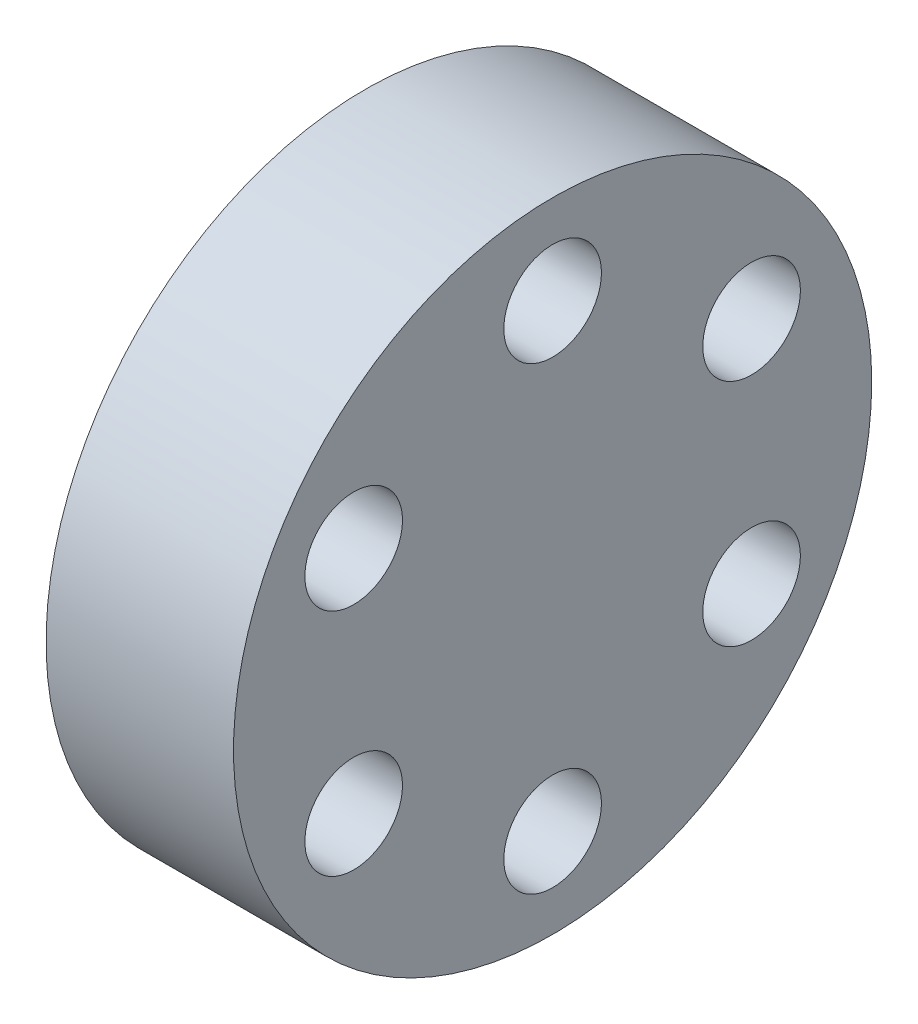
ISO-10303-21;
HEADER;
FILE_DESCRIPTION(('STEP AP214'),'2;1');
FILE_NAME('part.step','',(''),(''),'','','');
FILE_SCHEMA(('AUTOMOTIVE_DESIGN { 1 0 10303 214 1 1 1 1 }'));
ENDSEC;
DATA;
#1=APPLICATION_CONTEXT('core data for automotive mechanical design processes');
#2=APPLICATION_PROTOCOL_DEFINITION('international standard','automotive_design',2000,#1);
#3=PRODUCT_CONTEXT('',#1,'mechanical');
#4=PRODUCT('Part','Part','',(#3));
#5=PRODUCT_RELATED_PRODUCT_CATEGORY('part','',(#4));
#6=PRODUCT_DEFINITION_FORMATION('','',#4);
#7=PRODUCT_DEFINITION_CONTEXT('part definition',#1,'design');
#8=PRODUCT_DEFINITION('design','',#6,#7);
#9=PRODUCT_DEFINITION_SHAPE('','',#8);
#10=(LENGTH_UNIT() NAMED_UNIT(*) SI_UNIT(.MILLI.,.METRE.));
#11=(NAMED_UNIT(*) PLANE_ANGLE_UNIT() SI_UNIT($,.RADIAN.));
#12=(NAMED_UNIT(*) SI_UNIT($,.STERADIAN.) SOLID_ANGLE_UNIT());
#13=UNCERTAINTY_MEASURE_WITH_UNIT(LENGTH_MEASURE(1.E-05),#10,'distance_accuracy_value','');
#14=(GEOMETRIC_REPRESENTATION_CONTEXT(3) GLOBAL_UNCERTAINTY_ASSIGNED_CONTEXT((#13)) GLOBAL_UNIT_ASSIGNED_CONTEXT((#10,
#11,#12)) REPRESENTATION_CONTEXT('',''));
#15=CARTESIAN_POINT('',(0.,0.,0.));
#16=DIRECTION('',(0.,0.,1.));
#17=DIRECTION('',(1.,0.,0.));
#18=AXIS2_PLACEMENT_3D('',#15,#16,#17);
#19=CARTESIAN_POINT('',(6.5278,0.,0.));
#20=DIRECTION('',(-1.,0.,0.));
#21=DIRECTION('',(0.,0.,1.));
#22=AXIS2_PLACEMENT_3D('',#19,#20,#21);
#23=CYLINDRICAL_SURFACE('',#22,11.1125);
#24=CARTESIAN_POINT('',(6.5278,0.,0.));
#25=DIRECTION('',(1.,0.,0.));
#26=DIRECTION('',(0.,0.,-1.));
#27=AXIS2_PLACEMENT_3D('',#24,#25,#26);
#28=CIRCLE('',#27,11.1125);
#29=CARTESIAN_POINT('',(6.5278,0.,-11.1125));
#30=VERTEX_POINT('',#29);
#31=EDGE_CURVE('E10',#30,#30,#28,.T.);
#32=ORIENTED_EDGE('',*,*,#31,.F.);
#33=EDGE_LOOP('',(#32));
#34=FACE_BOUND('',#33,.T.);
#35=CARTESIAN_POINT('',(0.,0.,0.));
#36=DIRECTION('',(1.,0.,0.));
#37=DIRECTION('',(0.,0.,-1.));
#38=AXIS2_PLACEMENT_3D('',#35,#36,#37);
#39=CIRCLE('',#38,11.1125);
#40=CARTESIAN_POINT('',(0.,0.,-11.1125));
#41=VERTEX_POINT('',#40);
#42=EDGE_CURVE('E41',#41,#41,#39,.T.);
#43=ORIENTED_EDGE('',*,*,#42,.T.);
#44=EDGE_LOOP('',(#43));
#45=FACE_BOUND('',#44,.T.);
#46=ADVANCED_FACE('F38',(#34,#45),#23,.T.);
#47=CARTESIAN_POINT('',(6.5278,0.,0.));
#48=DIRECTION('',(1.,0.,0.));
#49=DIRECTION('',(0.,0.,-1.));
#50=AXIS2_PLACEMENT_3D('',#47,#48,#49);
#51=PLANE('',#50);
#52=CARTESIAN_POINT('',(6.5278,8.,0.));
#53=DIRECTION('',(1.,0.,0.));
#54=DIRECTION('',(0.,0.,-1.));
#55=AXIS2_PLACEMENT_3D('',#52,#53,#54);
#56=CIRCLE('',#55,1.7);
#57=CARTESIAN_POINT('',(6.5278,8.,-1.7));
#58=VERTEX_POINT('',#57);
#59=EDGE_CURVE('E82',#58,#58,#56,.T.);
#60=ORIENTED_EDGE('',*,*,#59,.F.);
#61=EDGE_LOOP('',(#60));
#62=FACE_BOUND('',#61,.T.);
#63=CARTESIAN_POINT('',(6.5278,4.,-6.92820323027551));
#64=DIRECTION('',(1.,0.,0.));
#65=DIRECTION('',(0.,0.,-1.));
#66=AXIS2_PLACEMENT_3D('',#63,#64,#65);
#67=CIRCLE('',#66,1.7);
#68=CARTESIAN_POINT('',(6.5278,4.,-8.62820323027551));
#69=VERTEX_POINT('',#68);
#70=EDGE_CURVE('E76',#69,#69,#67,.T.);
#71=ORIENTED_EDGE('',*,*,#70,.F.);
#72=EDGE_LOOP('',(#71));
#73=FACE_BOUND('',#72,.T.);
#74=CARTESIAN_POINT('',(6.5278,-4.,-6.92820323027551));
#75=DIRECTION('',(1.,0.,0.));
#76=DIRECTION('',(0.,0.,-1.));
#77=AXIS2_PLACEMENT_3D('',#74,#75,#76);
#78=CIRCLE('',#77,1.7);
#79=CARTESIAN_POINT('',(6.5278,-4.,-8.62820323027551));
#80=VERTEX_POINT('',#79);
#81=EDGE_CURVE('E70',#80,#80,#78,.T.);
#82=ORIENTED_EDGE('',*,*,#81,.F.);
#83=EDGE_LOOP('',(#82));
#84=FACE_BOUND('',#83,.T.);
#85=CARTESIAN_POINT('',(6.5278,-8.,0.));
#86=DIRECTION('',(1.,0.,0.));
#87=DIRECTION('',(0.,0.,-1.));
#88=AXIS2_PLACEMENT_3D('',#85,#86,#87);
#89=CIRCLE('',#88,1.7);
#90=CARTESIAN_POINT('',(6.5278,-8.,-1.7));
#91=VERTEX_POINT('',#90);
#92=EDGE_CURVE('E64',#91,#91,#89,.T.);
#93=ORIENTED_EDGE('',*,*,#92,.F.);
#94=EDGE_LOOP('',(#93));
#95=FACE_BOUND('',#94,.T.);
#96=CARTESIAN_POINT('',(6.5278,-4.,6.92820323027551));
#97=DIRECTION('',(1.,0.,0.));
#98=DIRECTION('',(0.,0.,-1.));
#99=AXIS2_PLACEMENT_3D('',#96,#97,#98);
#100=CIRCLE('',#99,1.7);
#101=CARTESIAN_POINT('',(6.5278,-4.,5.22820323027551));
#102=VERTEX_POINT('',#101);
#103=EDGE_CURVE('E58',#102,#102,#100,.T.);
#104=ORIENTED_EDGE('',*,*,#103,.F.);
#105=EDGE_LOOP('',(#104));
#106=FACE_BOUND('',#105,.T.);
#107=CARTESIAN_POINT('',(6.5278,4.,6.92820323027551));
#108=DIRECTION('',(1.,0.,0.));
#109=DIRECTION('',(0.,0.,-1.));
#110=AXIS2_PLACEMENT_3D('',#107,#108,#109);
#111=CIRCLE('',#110,1.7);
#112=CARTESIAN_POINT('',(6.5278,4.,5.22820323027551));
#113=VERTEX_POINT('',#112);
#114=EDGE_CURVE('E52',#113,#113,#111,.T.);
#115=ORIENTED_EDGE('',*,*,#114,.F.);
#116=EDGE_LOOP('',(#115));
#117=FACE_BOUND('',#116,.T.);
#118=ORIENTED_EDGE('',*,*,#31,.T.);
#119=EDGE_LOOP('',(#118));
#120=FACE_BOUND('',#119,.T.);
#121=ADVANCED_FACE('F88',(#62,#73,#84,#95,#106,#117,#120),#51,.T.);
#122=CARTESIAN_POINT('',(0.,0.,0.));
#123=DIRECTION('',(1.,0.,0.));
#124=DIRECTION('',(0.,0.,-1.));
#125=AXIS2_PLACEMENT_3D('',#122,#123,#124);
#126=PLANE('',#125);
#127=CARTESIAN_POINT('',(0.,8.,0.));
#128=DIRECTION('',(1.,0.,0.));
#129=DIRECTION('',(0.,0.,-1.));
#130=AXIS2_PLACEMENT_3D('',#127,#128,#129);
#131=CIRCLE('',#130,1.7);
#132=CARTESIAN_POINT('',(0.,8.,-1.7));
#133=VERTEX_POINT('',#132);
#134=EDGE_CURVE('E79',#133,#133,#131,.T.);
#135=ORIENTED_EDGE('',*,*,#134,.T.);
#136=EDGE_LOOP('',(#135));
#137=FACE_BOUND('',#136,.T.);
#138=CARTESIAN_POINT('',(0.,4.,-6.92820323027551));
#139=DIRECTION('',(1.,0.,0.));
#140=DIRECTION('',(0.,0.,-1.));
#141=AXIS2_PLACEMENT_3D('',#138,#139,#140);
#142=CIRCLE('',#141,1.7);
#143=CARTESIAN_POINT('',(0.,4.,-8.62820323027551));
#144=VERTEX_POINT('',#143);
#145=EDGE_CURVE('E73',#144,#144,#142,.T.);
#146=ORIENTED_EDGE('',*,*,#145,.T.);
#147=EDGE_LOOP('',(#146));
#148=FACE_BOUND('',#147,.T.);
#149=CARTESIAN_POINT('',(0.,-4.,-6.92820323027551));
#150=DIRECTION('',(1.,0.,0.));
#151=DIRECTION('',(0.,0.,-1.));
#152=AXIS2_PLACEMENT_3D('',#149,#150,#151);
#153=CIRCLE('',#152,1.7);
#154=CARTESIAN_POINT('',(0.,-4.,-8.62820323027551));
#155=VERTEX_POINT('',#154);
#156=EDGE_CURVE('E67',#155,#155,#153,.T.);
#157=ORIENTED_EDGE('',*,*,#156,.T.);
#158=EDGE_LOOP('',(#157));
#159=FACE_BOUND('',#158,.T.);
#160=CARTESIAN_POINT('',(0.,-8.,0.));
#161=DIRECTION('',(1.,0.,0.));
#162=DIRECTION('',(0.,0.,-1.));
#163=AXIS2_PLACEMENT_3D('',#160,#161,#162);
#164=CIRCLE('',#163,1.7);
#165=CARTESIAN_POINT('',(0.,-8.,-1.7));
#166=VERTEX_POINT('',#165);
#167=EDGE_CURVE('E61',#166,#166,#164,.T.);
#168=ORIENTED_EDGE('',*,*,#167,.T.);
#169=EDGE_LOOP('',(#168));
#170=FACE_BOUND('',#169,.T.);
#171=CARTESIAN_POINT('',(0.,-4.,6.92820323027551));
#172=DIRECTION('',(1.,0.,0.));
#173=DIRECTION('',(0.,0.,-1.));
#174=AXIS2_PLACEMENT_3D('',#171,#172,#173);
#175=CIRCLE('',#174,1.7);
#176=CARTESIAN_POINT('',(0.,-4.,5.22820323027551));
#177=VERTEX_POINT('',#176);
#178=EDGE_CURVE('E55',#177,#177,#175,.T.);
#179=ORIENTED_EDGE('',*,*,#178,.T.);
#180=EDGE_LOOP('',(#179));
#181=FACE_BOUND('',#180,.T.);
#182=CARTESIAN_POINT('',(0.,4.,6.92820323027551));
#183=DIRECTION('',(1.,0.,0.));
#184=DIRECTION('',(0.,0.,-1.));
#185=AXIS2_PLACEMENT_3D('',#182,#183,#184);
#186=CIRCLE('',#185,1.7);
#187=CARTESIAN_POINT('',(0.,4.,5.22820323027551));
#188=VERTEX_POINT('',#187);
#189=EDGE_CURVE('E48',#188,#188,#186,.T.);
#190=ORIENTED_EDGE('',*,*,#189,.T.);
#191=EDGE_LOOP('',(#190));
#192=FACE_BOUND('',#191,.T.);
#193=ORIENTED_EDGE('',*,*,#42,.F.);
#194=EDGE_LOOP('',(#193));
#195=FACE_BOUND('',#194,.T.);
#196=ADVANCED_FACE('F91',(#137,#148,#159,#170,#181,#192,#195),#126,.F.);
#197=CARTESIAN_POINT('',(6.5278,4.,6.92820323027551));
#198=DIRECTION('',(1.,0.,0.));
#199=DIRECTION('',(0.,0.,-1.));
#200=AXIS2_PLACEMENT_3D('',#197,#198,#199);
#201=CYLINDRICAL_SURFACE('',#200,1.7);
#202=ORIENTED_EDGE('',*,*,#189,.F.);
#203=EDGE_LOOP('',(#202));
#204=FACE_BOUND('',#203,.T.);
#205=ORIENTED_EDGE('',*,*,#114,.T.);
#206=EDGE_LOOP('',(#205));
#207=FACE_BOUND('',#206,.T.);
#208=ADVANCED_FACE('F103',(#204,#207),#201,.F.);
#209=CARTESIAN_POINT('',(6.5278,-4.,6.92820323027551));
#210=DIRECTION('',(1.,0.,0.));
#211=DIRECTION('',(0.,0.,-1.));
#212=AXIS2_PLACEMENT_3D('',#209,#210,#211);
#213=CYLINDRICAL_SURFACE('',#212,1.7);
#214=ORIENTED_EDGE('',*,*,#178,.F.);
#215=EDGE_LOOP('',(#214));
#216=FACE_BOUND('',#215,.T.);
#217=ORIENTED_EDGE('',*,*,#103,.T.);
#218=EDGE_LOOP('',(#217));
#219=FACE_BOUND('',#218,.T.);
#220=ADVANCED_FACE('F105',(#216,#219),#213,.F.);
#221=CARTESIAN_POINT('',(6.5278,-8.,0.));
#222=DIRECTION('',(1.,0.,0.));
#223=DIRECTION('',(0.,0.,-1.));
#224=AXIS2_PLACEMENT_3D('',#221,#222,#223);
#225=CYLINDRICAL_SURFACE('',#224,1.7);
#226=ORIENTED_EDGE('',*,*,#167,.F.);
#227=EDGE_LOOP('',(#226));
#228=FACE_BOUND('',#227,.T.);
#229=ORIENTED_EDGE('',*,*,#92,.T.);
#230=EDGE_LOOP('',(#229));
#231=FACE_BOUND('',#230,.T.);
#232=ADVANCED_FACE('F112',(#228,#231),#225,.F.);
#233=CARTESIAN_POINT('',(6.5278,-4.,-6.92820323027551));
#234=DIRECTION('',(1.,0.,0.));
#235=DIRECTION('',(0.,0.,-1.));
#236=AXIS2_PLACEMENT_3D('',#233,#234,#235);
#237=CYLINDRICAL_SURFACE('',#236,1.7);
#238=ORIENTED_EDGE('',*,*,#156,.F.);
#239=EDGE_LOOP('',(#238));
#240=FACE_BOUND('',#239,.T.);
#241=ORIENTED_EDGE('',*,*,#81,.T.);
#242=EDGE_LOOP('',(#241));
#243=FACE_BOUND('',#242,.T.);
#244=ADVANCED_FACE('F154',(#240,#243),#237,.F.);
#245=CARTESIAN_POINT('',(6.5278,4.,-6.92820323027551));
#246=DIRECTION('',(1.,0.,0.));
#247=DIRECTION('',(0.,0.,-1.));
#248=AXIS2_PLACEMENT_3D('',#245,#246,#247);
#249=CYLINDRICAL_SURFACE('',#248,1.7);
#250=ORIENTED_EDGE('',*,*,#145,.F.);
#251=EDGE_LOOP('',(#250));
#252=FACE_BOUND('',#251,.T.);
#253=ORIENTED_EDGE('',*,*,#70,.T.);
#254=EDGE_LOOP('',(#253));
#255=FACE_BOUND('',#254,.T.);
#256=ADVANCED_FACE('F164',(#252,#255),#249,.F.);
#257=CARTESIAN_POINT('',(6.5278,8.,0.));
#258=DIRECTION('',(1.,0.,0.));
#259=DIRECTION('',(0.,0.,-1.));
#260=AXIS2_PLACEMENT_3D('',#257,#258,#259);
#261=CYLINDRICAL_SURFACE('',#260,1.7);
#262=ORIENTED_EDGE('',*,*,#134,.F.);
#263=EDGE_LOOP('',(#262));
#264=FACE_BOUND('',#263,.T.);
#265=ORIENTED_EDGE('',*,*,#59,.T.);
#266=EDGE_LOOP('',(#265));
#267=FACE_BOUND('',#266,.T.);
#268=ADVANCED_FACE('F86',(#264,#267),#261,.F.);
#269=CLOSED_SHELL('',(#46,#121,#196,#208,#220,#232,#244,#256,#268));
#270=MANIFOLD_SOLID_BREP('B2',#269);
#271=ADVANCED_BREP_SHAPE_REPRESENTATION('',(#18,#270),#14);
#272=SHAPE_DEFINITION_REPRESENTATION(#9,#271);
ENDSEC;
END-ISO-10303-21;
